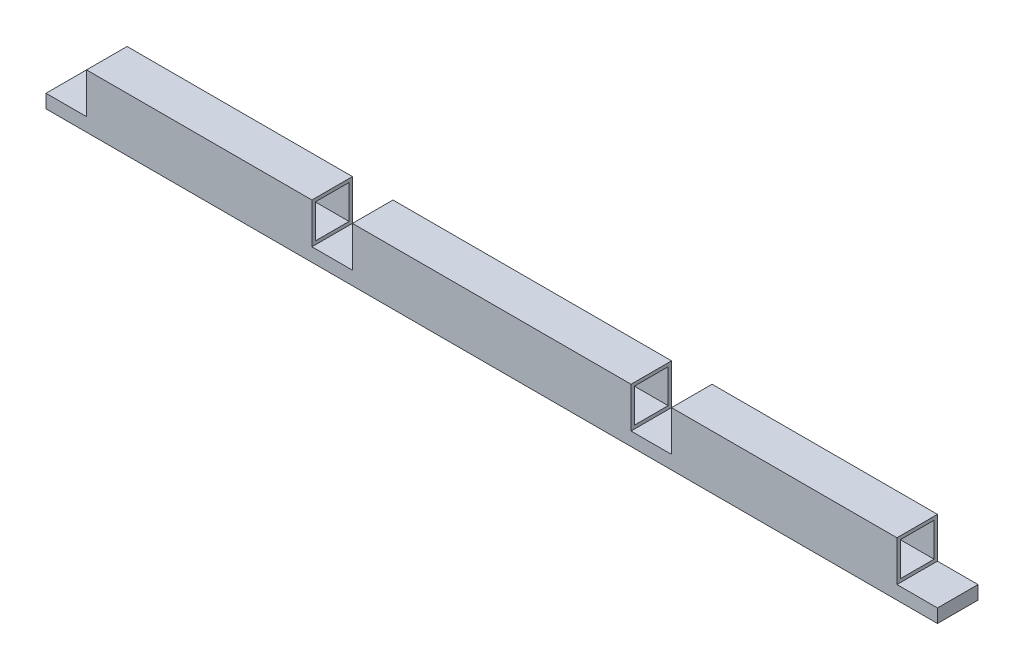
ISO-10303-21;
HEADER;
FILE_DESCRIPTION(('STEP AP214'),'2;1');
FILE_NAME('part.step','',(''),(''),'','','');
FILE_SCHEMA(('AUTOMOTIVE_DESIGN { 1 0 10303 214 1 1 1 1 }'));
ENDSEC;
DATA;
#1=APPLICATION_CONTEXT('core data for automotive mechanical design processes');
#2=APPLICATION_PROTOCOL_DEFINITION('international standard','automotive_design',2000,#1);
#3=PRODUCT_CONTEXT('',#1,'mechanical');
#4=PRODUCT('Part','Part','',(#3));
#5=PRODUCT_RELATED_PRODUCT_CATEGORY('part','',(#4));
#6=PRODUCT_DEFINITION_FORMATION('','',#4);
#7=PRODUCT_DEFINITION_CONTEXT('part definition',#1,'design');
#8=PRODUCT_DEFINITION('design','',#6,#7);
#9=PRODUCT_DEFINITION_SHAPE('','',#8);
#10=(LENGTH_UNIT() NAMED_UNIT(*) SI_UNIT(.MILLI.,.METRE.));
#11=(NAMED_UNIT(*) PLANE_ANGLE_UNIT() SI_UNIT($,.RADIAN.));
#12=(NAMED_UNIT(*) SI_UNIT($,.STERADIAN.) SOLID_ANGLE_UNIT());
#13=UNCERTAINTY_MEASURE_WITH_UNIT(LENGTH_MEASURE(1.E-05),#10,'distance_accuracy_value','');
#14=(GEOMETRIC_REPRESENTATION_CONTEXT(3) GLOBAL_UNCERTAINTY_ASSIGNED_CONTEXT((#13)) GLOBAL_UNIT_ASSIGNED_CONTEXT((#10,
#11,#12)) REPRESENTATION_CONTEXT('',''));
#15=CARTESIAN_POINT('',(0.,0.,0.));
#16=DIRECTION('',(0.,0.,1.));
#17=DIRECTION('',(1.,0.,0.));
#18=AXIS2_PLACEMENT_3D('',#15,#16,#17);
#19=CARTESIAN_POINT('',(0.,12.7,-38.1));
#20=DIRECTION('',(0.,1.,0.));
#21=DIRECTION('',(0.,0.,1.));
#22=AXIS2_PLACEMENT_3D('',#19,#20,#21);
#23=PLANE('',#22);
#24=DIRECTION('',(-1.,0.,0.));
#25=VECTOR('',#24,1.);
#26=CARTESIAN_POINT('',(0.,12.7,0.));
#27=LINE('',#26,#25);
#28=CARTESIAN_POINT('',(588.1,12.7,0.));
#29=VERTEX_POINT('',#28);
#30=CARTESIAN_POINT('',(550.,12.7,0.));
#31=VERTEX_POINT('',#30);
#32=EDGE_CURVE('E398',#29,#31,#27,.T.);
#33=ORIENTED_EDGE('',*,*,#32,.F.);
#34=DIRECTION('',(0.,0.,1.));
#35=VECTOR('',#34,1.);
#36=CARTESIAN_POINT('',(588.1,12.7,-38.1));
#37=LINE('',#36,#35);
#38=CARTESIAN_POINT('',(588.1,12.7,-38.1));
#39=VERTEX_POINT('',#38);
#40=EDGE_CURVE('E295',#39,#29,#37,.T.);
#41=ORIENTED_EDGE('',*,*,#40,.F.);
#42=DIRECTION('',(-1.,0.,0.));
#43=VECTOR('',#42,1.);
#44=CARTESIAN_POINT('',(0.,12.7,-38.1));
#45=LINE('',#44,#43);
#46=CARTESIAN_POINT('',(550.,12.7,-38.1));
#47=VERTEX_POINT('',#46);
#48=EDGE_CURVE('E386',#39,#47,#45,.T.);
#49=ORIENTED_EDGE('',*,*,#48,.T.);
#50=DIRECTION('',(0.,0.,-1.));
#51=VECTOR('',#50,1.);
#52=CARTESIAN_POINT('',(550.,12.7,-38.1));
#53=LINE('',#52,#51);
#54=EDGE_CURVE('E323',#31,#47,#53,.T.);
#55=ORIENTED_EDGE('',*,*,#54,.F.);
#56=EDGE_LOOP('',(#33,#41,#49,#55));
#57=FACE_BOUND('',#56,.T.);
#58=ADVANCED_FACE('F34',(#57),#23,.T.);
#59=CARTESIAN_POINT('',(838.1,12.7,-38.1));
#60=VERTEX_POINT('',#59);
#61=CARTESIAN_POINT('',(800.,12.7,-38.1));
#62=VERTEX_POINT('',#61);
#63=EDGE_CURVE('E382',#60,#62,#45,.T.);
#64=ORIENTED_EDGE('',*,*,#63,.T.);
#65=DIRECTION('',(0.,0.,-1.));
#66=VECTOR('',#65,1.);
#67=CARTESIAN_POINT('',(800.,12.7,-38.1));
#68=LINE('',#67,#66);
#69=CARTESIAN_POINT('',(800.,12.7,0.));
#70=VERTEX_POINT('',#69);
#71=EDGE_CURVE('E300',#70,#62,#68,.T.);
#72=ORIENTED_EDGE('',*,*,#71,.F.);
#73=CARTESIAN_POINT('',(838.1,12.7,0.));
#74=VERTEX_POINT('',#73);
#75=EDGE_CURVE('E375',#74,#70,#27,.T.);
#76=ORIENTED_EDGE('',*,*,#75,.F.);
#77=DIRECTION('',(0.,0.,1.));
#78=VECTOR('',#77,1.);
#79=CARTESIAN_POINT('',(838.1,12.7,-38.1));
#80=LINE('',#79,#78);
#81=EDGE_CURVE('E403',#60,#74,#80,.T.);
#82=ORIENTED_EDGE('',*,*,#81,.F.);
#83=EDGE_LOOP('',(#64,#72,#76,#82));
#84=FACE_BOUND('',#83,.T.);
#85=ADVANCED_FACE('F508',(#84),#23,.T.);
#86=CARTESIAN_POINT('',(288.1,12.7,0.));
#87=VERTEX_POINT('',#86);
#88=CARTESIAN_POINT('',(250.,12.7,0.));
#89=VERTEX_POINT('',#88);
#90=EDGE_CURVE('E486',#87,#89,#27,.T.);
#91=ORIENTED_EDGE('',*,*,#90,.F.);
#92=DIRECTION('',(0.,0.,1.));
#93=VECTOR('',#92,1.);
#94=CARTESIAN_POINT('',(288.1,12.7,-38.1));
#95=LINE('',#94,#93);
#96=CARTESIAN_POINT('',(288.1,12.7,-38.1));
#97=VERTEX_POINT('',#96);
#98=EDGE_CURVE('E318',#97,#87,#95,.T.);
#99=ORIENTED_EDGE('',*,*,#98,.F.);
#100=CARTESIAN_POINT('',(250.,12.7,-38.1));
#101=VERTEX_POINT('',#100);
#102=EDGE_CURVE('E517',#97,#101,#45,.T.);
#103=ORIENTED_EDGE('',*,*,#102,.T.);
#104=DIRECTION('',(0.,0.,-1.));
#105=VECTOR('',#104,1.);
#106=CARTESIAN_POINT('',(250.,12.7,0.));
#107=LINE('',#106,#105);
#108=EDGE_CURVE('E348',#89,#101,#107,.T.);
#109=ORIENTED_EDGE('',*,*,#108,.F.);
#110=EDGE_LOOP('',(#91,#99,#103,#109));
#111=FACE_BOUND('',#110,.T.);
#112=ADVANCED_FACE('F520',(#111),#23,.T.);
#113=CARTESIAN_POINT('',(0.,0.,-38.1));
#114=DIRECTION('',(-1.,0.,0.));
#115=DIRECTION('',(0.,0.,1.));
#116=AXIS2_PLACEMENT_3D('',#113,#114,#115);
#117=PLANE('',#116);
#118=DIRECTION('',(0.,-1.,0.));
#119=VECTOR('',#118,1.);
#120=CARTESIAN_POINT('',(0.,0.,0.));
#121=LINE('',#120,#119);
#122=CARTESIAN_POINT('',(0.,12.7,0.));
#123=VERTEX_POINT('',#122);
#124=CARTESIAN_POINT('',(0.,0.,0.));
#125=VERTEX_POINT('',#124);
#126=EDGE_CURVE('E370',#123,#125,#121,.T.);
#127=ORIENTED_EDGE('',*,*,#126,.F.);
#128=DIRECTION('',(0.,0.,1.));
#129=VECTOR('',#128,1.);
#130=CARTESIAN_POINT('',(0.,12.7,-38.1));
#131=LINE('',#130,#129);
#132=CARTESIAN_POINT('',(0.,12.7,-38.1));
#133=VERTEX_POINT('',#132);
#134=EDGE_CURVE('E399',#133,#123,#131,.T.);
#135=ORIENTED_EDGE('',*,*,#134,.F.);
#136=DIRECTION('',(0.,-1.,0.));
#137=VECTOR('',#136,1.);
#138=CARTESIAN_POINT('',(0.,0.,-38.1));
#139=LINE('',#138,#137);
#140=CARTESIAN_POINT('',(0.,0.,-38.1));
#141=VERTEX_POINT('',#140);
#142=EDGE_CURVE('E371',#133,#141,#139,.T.);
#143=ORIENTED_EDGE('',*,*,#142,.T.);
#144=DIRECTION('',(0.,0.,1.));
#145=VECTOR('',#144,1.);
#146=CARTESIAN_POINT('',(0.,0.,-38.1));
#147=LINE('',#146,#145);
#148=EDGE_CURVE('E385',#141,#125,#147,.T.);
#149=ORIENTED_EDGE('',*,*,#148,.T.);
#150=EDGE_LOOP('',(#127,#135,#143,#149));
#151=FACE_BOUND('',#150,.T.);
#152=ADVANCED_FACE('F36',(#151),#117,.T.);
#153=DIRECTION('',(0.,0.,1.));
#154=VECTOR('',#153,1.);
#155=CARTESIAN_POINT('',(38.1,12.7,0.));
#156=LINE('',#155,#154);
#157=CARTESIAN_POINT('',(38.1,12.7,-38.1));
#158=VERTEX_POINT('',#157);
#159=CARTESIAN_POINT('',(38.1,12.7,0.));
#160=VERTEX_POINT('',#159);
#161=EDGE_CURVE('E343',#158,#160,#156,.T.);
#162=ORIENTED_EDGE('',*,*,#161,.F.);
#163=EDGE_CURVE('E381',#158,#133,#45,.T.);
#164=ORIENTED_EDGE('',*,*,#163,.T.);
#165=ORIENTED_EDGE('',*,*,#134,.T.);
#166=EDGE_CURVE('E395',#160,#123,#27,.T.);
#167=ORIENTED_EDGE('',*,*,#166,.F.);
#168=EDGE_LOOP('',(#162,#164,#165,#167));
#169=FACE_BOUND('',#168,.T.);
#170=ADVANCED_FACE('F495',(#169),#23,.T.);
#171=CARTESIAN_POINT('',(838.1,0.,-38.1));
#172=DIRECTION('',(1.,0.,0.));
#173=DIRECTION('',(0.,0.,-1.));
#174=AXIS2_PLACEMENT_3D('',#171,#172,#173);
#175=PLANE('',#174);
#176=DIRECTION('',(0.,1.,0.));
#177=VECTOR('',#176,1.);
#178=CARTESIAN_POINT('',(838.1,0.,0.));
#179=LINE('',#178,#177);
#180=CARTESIAN_POINT('',(838.1,0.,0.));
#181=VERTEX_POINT('',#180);
#182=EDGE_CURVE('E392',#181,#74,#179,.T.);
#183=ORIENTED_EDGE('',*,*,#182,.F.);
#184=DIRECTION('',(0.,0.,1.));
#185=VECTOR('',#184,1.);
#186=CARTESIAN_POINT('',(838.1,0.,-38.1));
#187=LINE('',#186,#185);
#188=CARTESIAN_POINT('',(838.1,0.,-38.1));
#189=VERTEX_POINT('',#188);
#190=EDGE_CURVE('E405',#189,#181,#187,.T.);
#191=ORIENTED_EDGE('',*,*,#190,.F.);
#192=DIRECTION('',(0.,1.,0.));
#193=VECTOR('',#192,1.);
#194=CARTESIAN_POINT('',(838.1,0.,-38.1));
#195=LINE('',#194,#193);
#196=EDGE_CURVE('E378',#189,#60,#195,.T.);
#197=ORIENTED_EDGE('',*,*,#196,.T.);
#198=ORIENTED_EDGE('',*,*,#81,.T.);
#199=EDGE_LOOP('',(#183,#191,#197,#198));
#200=FACE_BOUND('',#199,.T.);
#201=ADVANCED_FACE('F529',(#200),#175,.T.);
#202=CARTESIAN_POINT('',(0.,0.,-38.1));
#203=DIRECTION('',(0.,-1.,0.));
#204=DIRECTION('',(0.,0.,-1.));
#205=AXIS2_PLACEMENT_3D('',#202,#203,#204);
#206=PLANE('',#205);
#207=DIRECTION('',(1.,0.,0.));
#208=VECTOR('',#207,1.);
#209=CARTESIAN_POINT('',(0.,0.,0.));
#210=LINE('',#209,#208);
#211=EDGE_CURVE('E389',#125,#181,#210,.T.);
#212=ORIENTED_EDGE('',*,*,#211,.F.);
#213=ORIENTED_EDGE('',*,*,#148,.F.);
#214=DIRECTION('',(1.,0.,0.));
#215=VECTOR('',#214,1.);
#216=CARTESIAN_POINT('',(0.,0.,-38.1));
#217=LINE('',#216,#215);
#218=EDGE_CURVE('E374',#141,#189,#217,.T.);
#219=ORIENTED_EDGE('',*,*,#218,.T.);
#220=ORIENTED_EDGE('',*,*,#190,.T.);
#221=EDGE_LOOP('',(#212,#213,#219,#220));
#222=FACE_BOUND('',#221,.T.);
#223=ADVANCED_FACE('F501',(#222),#206,.T.);
#224=CARTESIAN_POINT('',(0.,0.,-38.1));
#225=DIRECTION('',(0.,0.,-1.));
#226=DIRECTION('',(-1.,0.,0.));
#227=AXIS2_PLACEMENT_3D('',#224,#225,#226);
#228=PLANE('',#227);
#229=ORIENTED_EDGE('',*,*,#142,.F.);
#230=ORIENTED_EDGE('',*,*,#163,.F.);
#231=DIRECTION('',(0.,-1.,0.));
#232=VECTOR('',#231,1.);
#233=CARTESIAN_POINT('',(38.1,50.8,-38.1));
#234=LINE('',#233,#232);
#235=CARTESIAN_POINT('',(38.1,50.8,-38.1));
#236=VERTEX_POINT('',#235);
#237=EDGE_CURVE('E367',#236,#158,#234,.T.);
#238=ORIENTED_EDGE('',*,*,#237,.F.);
#239=DIRECTION('',(-1.,0.,0.));
#240=VECTOR('',#239,1.);
#241=CARTESIAN_POINT('',(38.1,50.8,-38.1));
#242=LINE('',#241,#240);
#243=CARTESIAN_POINT('',(250.,50.8,-38.1));
#244=VERTEX_POINT('',#243);
#245=EDGE_CURVE('E344',#244,#236,#242,.T.);
#246=ORIENTED_EDGE('',*,*,#245,.F.);
#247=DIRECTION('',(0.,-1.,0.));
#248=VECTOR('',#247,1.);
#249=CARTESIAN_POINT('',(250.,50.8,-38.1));
#250=LINE('',#249,#248);
#251=EDGE_CURVE('E354',#244,#101,#250,.T.);
#252=ORIENTED_EDGE('',*,*,#251,.T.);
#253=ORIENTED_EDGE('',*,*,#102,.F.);
#254=DIRECTION('',(0.,-1.,0.));
#255=VECTOR('',#254,1.);
#256=CARTESIAN_POINT('',(288.1,50.8,-38.1));
#257=LINE('',#256,#255);
#258=CARTESIAN_POINT('',(288.1,50.8,-38.1));
#259=VERTEX_POINT('',#258);
#260=EDGE_CURVE('E329',#259,#97,#257,.T.);
#261=ORIENTED_EDGE('',*,*,#260,.F.);
#262=DIRECTION('',(-1.,0.,0.));
#263=VECTOR('',#262,1.);
#264=CARTESIAN_POINT('',(288.1,50.8,-38.1));
#265=LINE('',#264,#263);
#266=CARTESIAN_POINT('',(550.,50.8,-38.1));
#267=VERTEX_POINT('',#266);
#268=EDGE_CURVE('E327',#267,#259,#265,.T.);
#269=ORIENTED_EDGE('',*,*,#268,.F.);
#270=DIRECTION('',(0.,-1.,0.));
#271=VECTOR('',#270,1.);
#272=CARTESIAN_POINT('',(550.,50.8,-38.1));
#273=LINE('',#272,#271);
#274=EDGE_CURVE('E334',#267,#47,#273,.T.);
#275=ORIENTED_EDGE('',*,*,#274,.T.);
#276=ORIENTED_EDGE('',*,*,#48,.F.);
#277=DIRECTION('',(0.,-1.,0.));
#278=VECTOR('',#277,1.);
#279=CARTESIAN_POINT('',(588.1,50.8,-38.1));
#280=LINE('',#279,#278);
#281=CARTESIAN_POINT('',(588.1,50.8,-38.1));
#282=VERTEX_POINT('',#281);
#283=EDGE_CURVE('E306',#282,#39,#280,.T.);
#284=ORIENTED_EDGE('',*,*,#283,.F.);
#285=DIRECTION('',(-1.,0.,0.));
#286=VECTOR('',#285,1.);
#287=CARTESIAN_POINT('',(800.,50.8,-38.1));
#288=LINE('',#287,#286);
#289=CARTESIAN_POINT('',(800.,50.8,-38.1));
#290=VERTEX_POINT('',#289);
#291=EDGE_CURVE('E304',#290,#282,#288,.T.);
#292=ORIENTED_EDGE('',*,*,#291,.F.);
#293=DIRECTION('',(0.,-1.,0.));
#294=VECTOR('',#293,1.);
#295=CARTESIAN_POINT('',(800.,50.8,-38.1));
#296=LINE('',#295,#294);
#297=EDGE_CURVE('E310',#290,#62,#296,.T.);
#298=ORIENTED_EDGE('',*,*,#297,.T.);
#299=ORIENTED_EDGE('',*,*,#63,.F.);
#300=ORIENTED_EDGE('',*,*,#196,.F.);
#301=ORIENTED_EDGE('',*,*,#218,.F.);
#302=EDGE_LOOP('',(#229,#230,#238,#246,#252,#253,#261,#269,#275,#276,#284,#292,#298,#299,#300,#301));
#303=FACE_BOUND('',#302,.T.);
#304=ADVANCED_FACE('F475',(#303),#228,.T.);
#305=CARTESIAN_POINT('',(0.,0.,0.));
#306=DIRECTION('',(0.,0.,-1.));
#307=DIRECTION('',(-1.,0.,0.));
#308=AXIS2_PLACEMENT_3D('',#305,#306,#307);
#309=PLANE('',#308);
#310=ORIENTED_EDGE('',*,*,#126,.T.);
#311=ORIENTED_EDGE('',*,*,#211,.T.);
#312=ORIENTED_EDGE('',*,*,#182,.T.);
#313=ORIENTED_EDGE('',*,*,#75,.T.);
#314=DIRECTION('',(0.,-1.,0.));
#315=VECTOR('',#314,1.);
#316=CARTESIAN_POINT('',(800.,50.8,0.));
#317=LINE('',#316,#315);
#318=CARTESIAN_POINT('',(800.,50.8,0.));
#319=VERTEX_POINT('',#318);
#320=EDGE_CURVE('E313',#319,#70,#317,.T.);
#321=ORIENTED_EDGE('',*,*,#320,.F.);
#322=DIRECTION('',(1.,0.,0.));
#323=VECTOR('',#322,1.);
#324=CARTESIAN_POINT('',(800.,50.8,0.));
#325=LINE('',#324,#323);
#326=CARTESIAN_POINT('',(588.1,50.8,0.));
#327=VERTEX_POINT('',#326);
#328=EDGE_CURVE('E299',#327,#319,#325,.T.);
#329=ORIENTED_EDGE('',*,*,#328,.F.);
#330=DIRECTION('',(0.,-1.,0.));
#331=VECTOR('',#330,1.);
#332=CARTESIAN_POINT('',(588.1,50.8,0.));
#333=LINE('',#332,#331);
#334=EDGE_CURVE('E315',#327,#29,#333,.T.);
#335=ORIENTED_EDGE('',*,*,#334,.T.);
#336=ORIENTED_EDGE('',*,*,#32,.T.);
#337=DIRECTION('',(0.,-1.,0.));
#338=VECTOR('',#337,1.);
#339=CARTESIAN_POINT('',(550.,50.8,0.));
#340=LINE('',#339,#338);
#341=CARTESIAN_POINT('',(550.,50.8,0.));
#342=VERTEX_POINT('',#341);
#343=EDGE_CURVE('E337',#342,#31,#340,.T.);
#344=ORIENTED_EDGE('',*,*,#343,.F.);
#345=DIRECTION('',(1.,0.,0.));
#346=VECTOR('',#345,1.);
#347=CARTESIAN_POINT('',(288.1,50.8,0.));
#348=LINE('',#347,#346);
#349=CARTESIAN_POINT('',(288.1,50.8,0.));
#350=VERTEX_POINT('',#349);
#351=EDGE_CURVE('E322',#350,#342,#348,.T.);
#352=ORIENTED_EDGE('',*,*,#351,.F.);
#353=DIRECTION('',(0.,-1.,0.));
#354=VECTOR('',#353,1.);
#355=CARTESIAN_POINT('',(288.1,50.8,0.));
#356=LINE('',#355,#354);
#357=EDGE_CURVE('E340',#350,#87,#356,.T.);
#358=ORIENTED_EDGE('',*,*,#357,.T.);
#359=ORIENTED_EDGE('',*,*,#90,.T.);
#360=DIRECTION('',(0.,-1.,0.));
#361=VECTOR('',#360,1.);
#362=CARTESIAN_POINT('',(250.,50.8,0.));
#363=LINE('',#362,#361);
#364=CARTESIAN_POINT('',(250.,50.8,0.));
#365=VERTEX_POINT('',#364);
#366=EDGE_CURVE('E361',#365,#89,#363,.T.);
#367=ORIENTED_EDGE('',*,*,#366,.F.);
#368=DIRECTION('',(1.,0.,0.));
#369=VECTOR('',#368,1.);
#370=CARTESIAN_POINT('',(38.1,50.8,0.));
#371=LINE('',#370,#369);
#372=CARTESIAN_POINT('',(38.1,50.8,0.));
#373=VERTEX_POINT('',#372);
#374=EDGE_CURVE('E350',#373,#365,#371,.T.);
#375=ORIENTED_EDGE('',*,*,#374,.F.);
#376=DIRECTION('',(0.,-1.,0.));
#377=VECTOR('',#376,1.);
#378=CARTESIAN_POINT('',(38.1,50.8,0.));
#379=LINE('',#378,#377);
#380=EDGE_CURVE('E364',#373,#160,#379,.T.);
#381=ORIENTED_EDGE('',*,*,#380,.T.);
#382=ORIENTED_EDGE('',*,*,#166,.T.);
#383=EDGE_LOOP('',(#310,#311,#312,#313,#321,#329,#335,#336,#344,#352,#358,#359,#367,#375,#381,#382));
#384=FACE_BOUND('',#383,.T.);
#385=ADVANCED_FACE('F483',(#384),#309,.F.);
#386=CARTESIAN_POINT('',(38.1,50.8,0.));
#387=DIRECTION('',(1.,0.,0.));
#388=DIRECTION('',(0.,0.,-1.));
#389=AXIS2_PLACEMENT_3D('',#386,#387,#388);
#390=PLANE('',#389);
#391=DIRECTION('',(0.,1.,0.));
#392=VECTOR('',#391,1.);
#393=CARTESIAN_POINT('',(38.1,15.8750000000001,-34.925));
#394=LINE('',#393,#392);
#395=CARTESIAN_POINT('',(38.1,15.8750000000001,-34.925));
#396=VERTEX_POINT('',#395);
#397=CARTESIAN_POINT('',(38.1,47.625,-34.925));
#398=VERTEX_POINT('',#397);
#399=EDGE_CURVE('E232',#396,#398,#394,.T.);
#400=ORIENTED_EDGE('',*,*,#399,.T.);
#401=DIRECTION('',(0.,0.,-1.));
#402=VECTOR('',#401,1.);
#403=CARTESIAN_POINT('',(38.1,47.625,-3.17500000000002));
#404=LINE('',#403,#402);
#405=CARTESIAN_POINT('',(38.1,47.625,-3.17500000000002));
#406=VERTEX_POINT('',#405);
#407=EDGE_CURVE('E49',#406,#398,#404,.T.);
#408=ORIENTED_EDGE('',*,*,#407,.F.);
#409=DIRECTION('',(0.,1.,0.));
#410=VECTOR('',#409,1.);
#411=CARTESIAN_POINT('',(38.1,15.875,-3.175));
#412=LINE('',#411,#410);
#413=CARTESIAN_POINT('',(38.1,15.875,-3.175));
#414=VERTEX_POINT('',#413);
#415=EDGE_CURVE('E240',#414,#406,#412,.T.);
#416=ORIENTED_EDGE('',*,*,#415,.F.);
#417=DIRECTION('',(0.,0.,-1.));
#418=VECTOR('',#417,1.);
#419=CARTESIAN_POINT('',(38.1,15.875,-3.175));
#420=LINE('',#419,#418);
#421=EDGE_CURVE('E222',#414,#396,#420,.T.);
#422=ORIENTED_EDGE('',*,*,#421,.T.);
#423=EDGE_LOOP('',(#400,#408,#416,#422));
#424=FACE_BOUND('',#423,.T.);
#425=ORIENTED_EDGE('',*,*,#161,.T.);
#426=ORIENTED_EDGE('',*,*,#380,.F.);
#427=DIRECTION('',(0.,0.,1.));
#428=VECTOR('',#427,1.);
#429=CARTESIAN_POINT('',(38.1,50.8,0.));
#430=LINE('',#429,#428);
#431=EDGE_CURVE('E347',#236,#373,#430,.T.);
#432=ORIENTED_EDGE('',*,*,#431,.F.);
#433=ORIENTED_EDGE('',*,*,#237,.T.);
#434=EDGE_LOOP('',(#425,#426,#432,#433));
#435=FACE_BOUND('',#434,.T.);
#436=ADVANCED_FACE('F237',(#424,#435),#390,.F.);
#437=CARTESIAN_POINT('',(250.,50.8,0.));
#438=DIRECTION('',(-1.,0.,0.));
#439=DIRECTION('',(0.,0.,1.));
#440=AXIS2_PLACEMENT_3D('',#437,#438,#439);
#441=PLANE('',#440);
#442=DIRECTION('',(0.,1.,0.));
#443=VECTOR('',#442,1.);
#444=CARTESIAN_POINT('',(250.,50.8,-3.17499999999991));
#445=LINE('',#444,#443);
#446=CARTESIAN_POINT('',(250.,15.875,-3.17499999999988));
#447=VERTEX_POINT('',#446);
#448=CARTESIAN_POINT('',(250.,47.625,-3.17499999999991));
#449=VERTEX_POINT('',#448);
#450=EDGE_CURVE('E280',#447,#449,#445,.T.);
#451=ORIENTED_EDGE('',*,*,#450,.T.);
#452=DIRECTION('',(0.,0.,-1.));
#453=VECTOR('',#452,1.);
#454=CARTESIAN_POINT('',(250.,47.625,0.));
#455=LINE('',#454,#453);
#456=CARTESIAN_POINT('',(250.,47.625,-34.9249999999999));
#457=VERTEX_POINT('',#456);
#458=EDGE_CURVE('E292',#449,#457,#455,.T.);
#459=ORIENTED_EDGE('',*,*,#458,.T.);
#460=DIRECTION('',(0.,1.,0.));
#461=VECTOR('',#460,1.);
#462=CARTESIAN_POINT('',(250.,50.8,-34.9249999999999));
#463=LINE('',#462,#461);
#464=CARTESIAN_POINT('',(250.,15.8750000000001,-34.9249999999999));
#465=VERTEX_POINT('',#464);
#466=EDGE_CURVE('E261',#465,#457,#463,.T.);
#467=ORIENTED_EDGE('',*,*,#466,.F.);
#468=DIRECTION('',(0.,0.,-1.));
#469=VECTOR('',#468,1.);
#470=CARTESIAN_POINT('',(250.,15.875,0.));
#471=LINE('',#470,#469);
#472=EDGE_CURVE('E225',#447,#465,#471,.T.);
#473=ORIENTED_EDGE('',*,*,#472,.F.);
#474=EDGE_LOOP('',(#451,#459,#467,#473));
#475=FACE_BOUND('',#474,.T.);
#476=ORIENTED_EDGE('',*,*,#108,.T.);
#477=ORIENTED_EDGE('',*,*,#251,.F.);
#478=DIRECTION('',(0.,0.,-1.));
#479=VECTOR('',#478,1.);
#480=CARTESIAN_POINT('',(250.,50.8,0.));
#481=LINE('',#480,#479);
#482=EDGE_CURVE('E352',#365,#244,#481,.T.);
#483=ORIENTED_EDGE('',*,*,#482,.F.);
#484=ORIENTED_EDGE('',*,*,#366,.T.);
#485=EDGE_LOOP('',(#476,#477,#483,#484));
#486=FACE_BOUND('',#485,.T.);
#487=ADVANCED_FACE('F523',(#475,#486),#441,.F.);
#488=CARTESIAN_POINT('',(0.,50.8,0.));
#489=DIRECTION('',(0.,1.,0.));
#490=DIRECTION('',(0.,0.,1.));
#491=AXIS2_PLACEMENT_3D('',#488,#489,#490);
#492=PLANE('',#491);
#493=ORIENTED_EDGE('',*,*,#245,.T.);
#494=ORIENTED_EDGE('',*,*,#431,.T.);
#495=ORIENTED_EDGE('',*,*,#374,.T.);
#496=ORIENTED_EDGE('',*,*,#482,.T.);
#497=EDGE_LOOP('',(#493,#494,#495,#496));
#498=FACE_BOUND('',#497,.T.);
#499=ADVANCED_FACE('F528',(#498),#492,.T.);
#500=CARTESIAN_POINT('',(288.1,50.8,-38.1));
#501=DIRECTION('',(1.,0.,0.));
#502=DIRECTION('',(0.,0.,-1.));
#503=AXIS2_PLACEMENT_3D('',#500,#501,#502);
#504=PLANE('',#503);
#505=DIRECTION('',(0.,-1.,0.));
#506=VECTOR('',#505,1.);
#507=CARTESIAN_POINT('',(288.1,50.8,-34.9249999999999));
#508=LINE('',#507,#506);
#509=CARTESIAN_POINT('',(288.1,47.625,-34.9249999999999));
#510=VERTEX_POINT('',#509);
#511=CARTESIAN_POINT('',(288.1,15.8750000000001,-34.9249999999998));
#512=VERTEX_POINT('',#511);
#513=EDGE_CURVE('E259',#510,#512,#508,.T.);
#514=ORIENTED_EDGE('',*,*,#513,.F.);
#515=DIRECTION('',(0.,0.,1.));
#516=VECTOR('',#515,1.);
#517=CARTESIAN_POINT('',(288.1,47.625,-38.1));
#518=LINE('',#517,#516);
#519=CARTESIAN_POINT('',(288.1,47.625,-3.17499999999988));
#520=VERTEX_POINT('',#519);
#521=EDGE_CURVE('E289',#510,#520,#518,.T.);
#522=ORIENTED_EDGE('',*,*,#521,.T.);
#523=DIRECTION('',(0.,-1.,0.));
#524=VECTOR('',#523,1.);
#525=CARTESIAN_POINT('',(288.1,50.8,-3.17499999999989));
#526=LINE('',#525,#524);
#527=CARTESIAN_POINT('',(288.1,15.875,-3.17499999999986));
#528=VERTEX_POINT('',#527);
#529=EDGE_CURVE('E277',#520,#528,#526,.T.);
#530=ORIENTED_EDGE('',*,*,#529,.T.);
#531=DIRECTION('',(0.,0.,1.));
#532=VECTOR('',#531,1.);
#533=CARTESIAN_POINT('',(288.1,15.8750000000001,-38.1));
#534=LINE('',#533,#532);
#535=EDGE_CURVE('E268',#512,#528,#534,.T.);
#536=ORIENTED_EDGE('',*,*,#535,.F.);
#537=EDGE_LOOP('',(#514,#522,#530,#536));
#538=FACE_BOUND('',#537,.T.);
#539=ORIENTED_EDGE('',*,*,#98,.T.);
#540=ORIENTED_EDGE('',*,*,#357,.F.);
#541=DIRECTION('',(0.,0.,1.));
#542=VECTOR('',#541,1.);
#543=CARTESIAN_POINT('',(288.1,50.8,-38.1));
#544=LINE('',#543,#542);
#545=EDGE_CURVE('E319',#259,#350,#544,.T.);
#546=ORIENTED_EDGE('',*,*,#545,.F.);
#547=ORIENTED_EDGE('',*,*,#260,.T.);
#548=EDGE_LOOP('',(#539,#540,#546,#547));
#549=FACE_BOUND('',#548,.T.);
#550=ADVANCED_FACE('F438',(#538,#549),#504,.F.);
#551=CARTESIAN_POINT('',(550.,50.8,-38.1));
#552=DIRECTION('',(-1.,0.,0.));
#553=DIRECTION('',(0.,0.,1.));
#554=AXIS2_PLACEMENT_3D('',#551,#552,#553);
#555=PLANE('',#554);
#556=DIRECTION('',(0.,1.,0.));
#557=VECTOR('',#556,1.);
#558=CARTESIAN_POINT('',(550.,50.8,-3.17499999999975));
#559=LINE('',#558,#557);
#560=CARTESIAN_POINT('',(550.,15.875,-3.17499999999972));
#561=VERTEX_POINT('',#560);
#562=CARTESIAN_POINT('',(550.,47.625,-3.17499999999974));
#563=VERTEX_POINT('',#562);
#564=EDGE_CURVE('E274',#561,#563,#559,.T.);
#565=ORIENTED_EDGE('',*,*,#564,.T.);
#566=DIRECTION('',(0.,0.,-1.));
#567=VECTOR('',#566,1.);
#568=CARTESIAN_POINT('',(550.,47.625,-38.1));
#569=LINE('',#568,#567);
#570=CARTESIAN_POINT('',(550.,47.625,-34.9249999999997));
#571=VERTEX_POINT('',#570);
#572=EDGE_CURVE('E286',#563,#571,#569,.T.);
#573=ORIENTED_EDGE('',*,*,#572,.T.);
#574=DIRECTION('',(0.,1.,0.));
#575=VECTOR('',#574,1.);
#576=CARTESIAN_POINT('',(550.,50.8,-34.9249999999997));
#577=LINE('',#576,#575);
#578=CARTESIAN_POINT('',(550.,15.8750000000001,-34.9249999999997));
#579=VERTEX_POINT('',#578);
#580=EDGE_CURVE('E257',#579,#571,#577,.T.);
#581=ORIENTED_EDGE('',*,*,#580,.F.);
#582=DIRECTION('',(0.,0.,-1.));
#583=VECTOR('',#582,1.);
#584=CARTESIAN_POINT('',(550.,15.8750000000001,-38.1));
#585=LINE('',#584,#583);
#586=EDGE_CURVE('E265',#561,#579,#585,.T.);
#587=ORIENTED_EDGE('',*,*,#586,.F.);
#588=EDGE_LOOP('',(#565,#573,#581,#587));
#589=FACE_BOUND('',#588,.T.);
#590=ORIENTED_EDGE('',*,*,#54,.T.);
#591=ORIENTED_EDGE('',*,*,#274,.F.);
#592=DIRECTION('',(0.,0.,-1.));
#593=VECTOR('',#592,1.);
#594=CARTESIAN_POINT('',(550.,50.8,-38.1));
#595=LINE('',#594,#593);
#596=EDGE_CURVE('E325',#342,#267,#595,.T.);
#597=ORIENTED_EDGE('',*,*,#596,.F.);
#598=ORIENTED_EDGE('',*,*,#343,.T.);
#599=EDGE_LOOP('',(#590,#591,#597,#598));
#600=FACE_BOUND('',#599,.T.);
#601=ADVANCED_FACE('F460',(#589,#600),#555,.F.);
#602=CARTESIAN_POINT('',(0.,50.8,0.));
#603=DIRECTION('',(0.,1.,0.));
#604=DIRECTION('',(0.,0.,1.));
#605=AXIS2_PLACEMENT_3D('',#602,#603,#604);
#606=PLANE('',#605);
#607=ORIENTED_EDGE('',*,*,#545,.T.);
#608=ORIENTED_EDGE('',*,*,#351,.T.);
#609=ORIENTED_EDGE('',*,*,#596,.T.);
#610=ORIENTED_EDGE('',*,*,#268,.T.);
#611=EDGE_LOOP('',(#607,#608,#609,#610));
#612=FACE_BOUND('',#611,.T.);
#613=ADVANCED_FACE('F463',(#612),#606,.T.);
#614=CARTESIAN_POINT('',(588.1,50.8,-38.1));
#615=DIRECTION('',(1.,0.,0.));
#616=DIRECTION('',(0.,0.,-1.));
#617=AXIS2_PLACEMENT_3D('',#614,#615,#616);
#618=PLANE('',#617);
#619=DIRECTION('',(0.,-1.,0.));
#620=VECTOR('',#619,1.);
#621=CARTESIAN_POINT('',(588.1,50.8,-34.9249999999997));
#622=LINE('',#621,#620);
#623=CARTESIAN_POINT('',(588.1,47.625,-34.9249999999997));
#624=VERTEX_POINT('',#623);
#625=CARTESIAN_POINT('',(588.1,15.8750000000001,-34.9249999999997));
#626=VERTEX_POINT('',#625);
#627=EDGE_CURVE('E255',#624,#626,#622,.T.);
#628=ORIENTED_EDGE('',*,*,#627,.F.);
#629=DIRECTION('',(0.,0.,1.));
#630=VECTOR('',#629,1.);
#631=CARTESIAN_POINT('',(588.1,47.625,-38.1));
#632=LINE('',#631,#630);
#633=CARTESIAN_POINT('',(588.1,47.625,-3.17499999999972));
#634=VERTEX_POINT('',#633);
#635=EDGE_CURVE('E283',#624,#634,#632,.T.);
#636=ORIENTED_EDGE('',*,*,#635,.T.);
#637=DIRECTION('',(0.,-1.,0.));
#638=VECTOR('',#637,1.);
#639=CARTESIAN_POINT('',(588.1,50.8,-3.17499999999973));
#640=LINE('',#639,#638);
#641=CARTESIAN_POINT('',(588.1,15.875,-3.1749999999997));
#642=VERTEX_POINT('',#641);
#643=EDGE_CURVE('E271',#634,#642,#640,.T.);
#644=ORIENTED_EDGE('',*,*,#643,.T.);
#645=DIRECTION('',(0.,0.,1.));
#646=VECTOR('',#645,1.);
#647=CARTESIAN_POINT('',(588.1,15.8750000000001,-38.1));
#648=LINE('',#647,#646);
#649=EDGE_CURVE('E263',#626,#642,#648,.T.);
#650=ORIENTED_EDGE('',*,*,#649,.F.);
#651=EDGE_LOOP('',(#628,#636,#644,#650));
#652=FACE_BOUND('',#651,.T.);
#653=ORIENTED_EDGE('',*,*,#40,.T.);
#654=ORIENTED_EDGE('',*,*,#334,.F.);
#655=DIRECTION('',(0.,0.,1.));
#656=VECTOR('',#655,1.);
#657=CARTESIAN_POINT('',(588.1,50.8,-38.1));
#658=LINE('',#657,#656);
#659=EDGE_CURVE('E296',#282,#327,#658,.T.);
#660=ORIENTED_EDGE('',*,*,#659,.F.);
#661=ORIENTED_EDGE('',*,*,#283,.T.);
#662=EDGE_LOOP('',(#653,#654,#660,#661));
#663=FACE_BOUND('',#662,.T.);
#664=ADVANCED_FACE('F450',(#652,#663),#618,.F.);
#665=CARTESIAN_POINT('',(800.,50.8,-38.1));
#666=DIRECTION('',(-1.,0.,0.));
#667=DIRECTION('',(0.,0.,1.));
#668=AXIS2_PLACEMENT_3D('',#665,#666,#667);
#669=PLANE('',#668);
#670=DIRECTION('',(0.,1.,0.));
#671=VECTOR('',#670,1.);
#672=CARTESIAN_POINT('',(800.,50.8,-3.17499999999961));
#673=LINE('',#672,#671);
#674=CARTESIAN_POINT('',(800.,15.875,-3.17499999999958));
#675=VERTEX_POINT('',#674);
#676=CARTESIAN_POINT('',(800.,47.625,-3.17499999999961));
#677=VERTEX_POINT('',#676);
#678=EDGE_CURVE('E42',#675,#677,#673,.T.);
#679=ORIENTED_EDGE('',*,*,#678,.T.);
#680=DIRECTION('',(0.,0.,-1.));
#681=VECTOR('',#680,1.);
#682=CARTESIAN_POINT('',(800.,47.625,-38.1));
#683=LINE('',#682,#681);
#684=CARTESIAN_POINT('',(800.,47.625,-34.9249999999996));
#685=VERTEX_POINT('',#684);
#686=EDGE_CURVE('E11',#677,#685,#683,.T.);
#687=ORIENTED_EDGE('',*,*,#686,.T.);
#688=DIRECTION('',(0.,1.,0.));
#689=VECTOR('',#688,1.);
#690=CARTESIAN_POINT('',(800.,50.8,-34.9249999999996));
#691=LINE('',#690,#689);
#692=CARTESIAN_POINT('',(800.,15.8750000000001,-34.9249999999996));
#693=VERTEX_POINT('',#692);
#694=EDGE_CURVE('E402',#693,#685,#691,.T.);
#695=ORIENTED_EDGE('',*,*,#694,.F.);
#696=DIRECTION('',(0.,0.,-1.));
#697=VECTOR('',#696,1.);
#698=CARTESIAN_POINT('',(800.,15.8750000000001,-38.1));
#699=LINE('',#698,#697);
#700=EDGE_CURVE('E409',#675,#693,#699,.T.);
#701=ORIENTED_EDGE('',*,*,#700,.F.);
#702=EDGE_LOOP('',(#679,#687,#695,#701));
#703=FACE_BOUND('',#702,.T.);
#704=ORIENTED_EDGE('',*,*,#71,.T.);
#705=ORIENTED_EDGE('',*,*,#297,.F.);
#706=DIRECTION('',(0.,0.,-1.));
#707=VECTOR('',#706,1.);
#708=CARTESIAN_POINT('',(800.,50.8,-38.1));
#709=LINE('',#708,#707);
#710=EDGE_CURVE('E302',#319,#290,#709,.T.);
#711=ORIENTED_EDGE('',*,*,#710,.F.);
#712=ORIENTED_EDGE('',*,*,#320,.T.);
#713=EDGE_LOOP('',(#704,#705,#711,#712));
#714=FACE_BOUND('',#713,.T.);
#715=ADVANCED_FACE('F414',(#703,#714),#669,.F.);
#716=CARTESIAN_POINT('',(0.,50.8,0.));
#717=DIRECTION('',(0.,-1.,0.));
#718=DIRECTION('',(0.,0.,-1.));
#719=AXIS2_PLACEMENT_3D('',#716,#717,#718);
#720=PLANE('',#719);
#721=ORIENTED_EDGE('',*,*,#659,.T.);
#722=ORIENTED_EDGE('',*,*,#328,.T.);
#723=ORIENTED_EDGE('',*,*,#710,.T.);
#724=ORIENTED_EDGE('',*,*,#291,.T.);
#725=EDGE_LOOP('',(#721,#722,#723,#724));
#726=FACE_BOUND('',#725,.T.);
#727=ADVANCED_FACE('F516',(#726),#720,.F.);
#728=CARTESIAN_POINT('',(838.1,15.8750000000001,-34.9249999999995));
#729=DIRECTION('',(0.,0.,1.));
#730=DIRECTION('',(1.,0.,0.));
#731=AXIS2_PLACEMENT_3D('',#728,#729,#730);
#732=PLANE('',#731);
#733=ORIENTED_EDGE('',*,*,#627,.T.);
#734=DIRECTION('',(-1.,0.,0.));
#735=VECTOR('',#734,1.);
#736=CARTESIAN_POINT('',(838.1,15.8750000000001,-34.9249999999995));
#737=LINE('',#736,#735);
#738=EDGE_CURVE('E230',#693,#626,#737,.T.);
#739=ORIENTED_EDGE('',*,*,#738,.F.);
#740=ORIENTED_EDGE('',*,*,#694,.T.);
#741=DIRECTION('',(-1.,0.,0.));
#742=VECTOR('',#741,1.);
#743=CARTESIAN_POINT('',(838.1,47.625,-34.9249999999996));
#744=LINE('',#743,#742);
#745=EDGE_CURVE('E228',#685,#624,#744,.T.);
#746=ORIENTED_EDGE('',*,*,#745,.T.);
#747=EDGE_LOOP('',(#733,#739,#740,#746));
#748=FACE_BOUND('',#747,.T.);
#749=ADVANCED_FACE('F453',(#748),#732,.T.);
#750=CARTESIAN_POINT('',(838.1,15.875,-3.17499999999956));
#751=DIRECTION('',(0.,1.,0.));
#752=DIRECTION('',(0.,0.,1.));
#753=AXIS2_PLACEMENT_3D('',#750,#751,#752);
#754=PLANE('',#753);
#755=ORIENTED_EDGE('',*,*,#649,.T.);
#756=DIRECTION('',(-1.,0.,0.));
#757=VECTOR('',#756,1.);
#758=CARTESIAN_POINT('',(838.1,15.875,-3.17499999999956));
#759=LINE('',#758,#757);
#760=EDGE_CURVE('E248',#675,#642,#759,.T.);
#761=ORIENTED_EDGE('',*,*,#760,.F.);
#762=ORIENTED_EDGE('',*,*,#700,.T.);
#763=ORIENTED_EDGE('',*,*,#738,.T.);
#764=EDGE_LOOP('',(#755,#761,#762,#763));
#765=FACE_BOUND('',#764,.T.);
#766=ADVANCED_FACE('F424',(#765),#754,.T.);
#767=CARTESIAN_POINT('',(838.1,15.875,-3.17499999999956));
#768=DIRECTION('',(0.,0.,1.));
#769=DIRECTION('',(0.,-1.,0.));
#770=AXIS2_PLACEMENT_3D('',#767,#768,#769);
#771=PLANE('',#770);
#772=DIRECTION('',(-1.,0.,0.));
#773=VECTOR('',#772,1.);
#774=CARTESIAN_POINT('',(838.1,47.625,-3.17499999999958));
#775=LINE('',#774,#773);
#776=EDGE_CURVE('E249',#677,#634,#775,.T.);
#777=ORIENTED_EDGE('',*,*,#776,.F.);
#778=ORIENTED_EDGE('',*,*,#678,.F.);
#779=ORIENTED_EDGE('',*,*,#760,.T.);
#780=ORIENTED_EDGE('',*,*,#643,.F.);
#781=EDGE_LOOP('',(#777,#778,#779,#780));
#782=FACE_BOUND('',#781,.T.);
#783=ADVANCED_FACE('F421',(#782),#771,.F.);
#784=CARTESIAN_POINT('',(838.1,47.625,-3.17499999999958));
#785=DIRECTION('',(0.,1.,0.));
#786=DIRECTION('',(0.,0.,1.));
#787=AXIS2_PLACEMENT_3D('',#784,#785,#786);
#788=PLANE('',#787);
#789=ORIENTED_EDGE('',*,*,#745,.F.);
#790=ORIENTED_EDGE('',*,*,#686,.F.);
#791=ORIENTED_EDGE('',*,*,#776,.T.);
#792=ORIENTED_EDGE('',*,*,#635,.F.);
#793=EDGE_LOOP('',(#789,#790,#791,#792));
#794=FACE_BOUND('',#793,.T.);
#795=ADVANCED_FACE('F447',(#794),#788,.F.);
#796=ORIENTED_EDGE('',*,*,#513,.T.);
#797=EDGE_CURVE('E227',#579,#512,#737,.T.);
#798=ORIENTED_EDGE('',*,*,#797,.F.);
#799=ORIENTED_EDGE('',*,*,#580,.T.);
#800=EDGE_CURVE('E254',#571,#510,#744,.T.);
#801=ORIENTED_EDGE('',*,*,#800,.T.);
#802=EDGE_LOOP('',(#796,#798,#799,#801));
#803=FACE_BOUND('',#802,.T.);
#804=ADVANCED_FACE('F458',(#803),#732,.T.);
#805=ORIENTED_EDGE('',*,*,#535,.T.);
#806=EDGE_CURVE('E251',#561,#528,#759,.T.);
#807=ORIENTED_EDGE('',*,*,#806,.F.);
#808=ORIENTED_EDGE('',*,*,#586,.T.);
#809=ORIENTED_EDGE('',*,*,#797,.T.);
#810=EDGE_LOOP('',(#805,#807,#808,#809));
#811=FACE_BOUND('',#810,.T.);
#812=ADVANCED_FACE('F455',(#811),#754,.T.);
#813=EDGE_CURVE('E247',#563,#520,#775,.T.);
#814=ORIENTED_EDGE('',*,*,#813,.F.);
#815=ORIENTED_EDGE('',*,*,#564,.F.);
#816=ORIENTED_EDGE('',*,*,#806,.T.);
#817=ORIENTED_EDGE('',*,*,#529,.F.);
#818=EDGE_LOOP('',(#814,#815,#816,#817));
#819=FACE_BOUND('',#818,.T.);
#820=ADVANCED_FACE('F431',(#819),#771,.F.);
#821=ORIENTED_EDGE('',*,*,#800,.F.);
#822=ORIENTED_EDGE('',*,*,#572,.F.);
#823=ORIENTED_EDGE('',*,*,#813,.T.);
#824=ORIENTED_EDGE('',*,*,#521,.F.);
#825=EDGE_LOOP('',(#821,#822,#823,#824));
#826=FACE_BOUND('',#825,.T.);
#827=ADVANCED_FACE('F443',(#826),#788,.F.);
#828=EDGE_CURVE('E245',#449,#406,#775,.T.);
#829=ORIENTED_EDGE('',*,*,#828,.T.);
#830=ORIENTED_EDGE('',*,*,#407,.T.);
#831=EDGE_CURVE('E234',#457,#398,#744,.T.);
#832=ORIENTED_EDGE('',*,*,#831,.F.);
#833=ORIENTED_EDGE('',*,*,#458,.F.);
#834=EDGE_LOOP('',(#829,#830,#832,#833));
#835=FACE_BOUND('',#834,.T.);
#836=ADVANCED_FACE('F563',(#835),#788,.F.);
#837=EDGE_CURVE('E250',#447,#414,#759,.T.);
#838=ORIENTED_EDGE('',*,*,#837,.T.);
#839=ORIENTED_EDGE('',*,*,#415,.T.);
#840=ORIENTED_EDGE('',*,*,#828,.F.);
#841=ORIENTED_EDGE('',*,*,#450,.F.);
#842=EDGE_LOOP('',(#838,#839,#840,#841));
#843=FACE_BOUND('',#842,.T.);
#844=ADVANCED_FACE('F566',(#843),#771,.F.);
#845=ORIENTED_EDGE('',*,*,#472,.T.);
#846=EDGE_CURVE('E57',#465,#396,#737,.T.);
#847=ORIENTED_EDGE('',*,*,#846,.T.);
#848=ORIENTED_EDGE('',*,*,#421,.F.);
#849=ORIENTED_EDGE('',*,*,#837,.F.);
#850=EDGE_LOOP('',(#845,#847,#848,#849));
#851=FACE_BOUND('',#850,.T.);
#852=ADVANCED_FACE('F219',(#851),#754,.T.);
#853=ORIENTED_EDGE('',*,*,#466,.T.);
#854=ORIENTED_EDGE('',*,*,#831,.T.);
#855=ORIENTED_EDGE('',*,*,#399,.F.);
#856=ORIENTED_EDGE('',*,*,#846,.F.);
#857=EDGE_LOOP('',(#853,#854,#855,#856));
#858=FACE_BOUND('',#857,.T.);
#859=ADVANCED_FACE('F233',(#858),#732,.T.);
#860=CLOSED_SHELL('',(#58,#85,#112,#152,#170,#201,#223,#304,#385,#436,#487,#499,#550,#601,#613,
#664,#715,#727,#749,#766,#783,#795,#804,#812,#820,#827,#836,#844,#852,#859));
#861=MANIFOLD_SOLID_BREP('B2',#860);
#862=ADVANCED_BREP_SHAPE_REPRESENTATION('',(#18,#861),#14);
#863=SHAPE_DEFINITION_REPRESENTATION(#9,#862);
ENDSEC;
END-ISO-10303-21;
